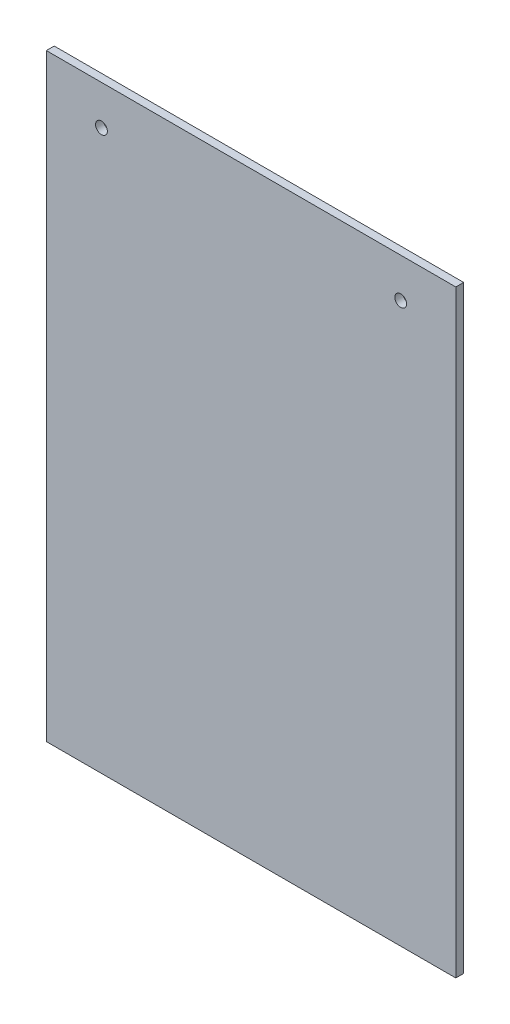
ISO-10303-21;
HEADER;
FILE_DESCRIPTION(('STEP AP214'),'2;1');
FILE_NAME('part.step','',(''),(''),'','','');
FILE_SCHEMA(('AUTOMOTIVE_DESIGN { 1 0 10303 214 1 1 1 1 }'));
ENDSEC;
DATA;
#1=APPLICATION_CONTEXT('core data for automotive mechanical design processes');
#2=APPLICATION_PROTOCOL_DEFINITION('international standard','automotive_design',2000,#1);
#3=PRODUCT_CONTEXT('',#1,'mechanical');
#4=PRODUCT('Part','Part','',(#3));
#5=PRODUCT_RELATED_PRODUCT_CATEGORY('part','',(#4));
#6=PRODUCT_DEFINITION_FORMATION('','',#4);
#7=PRODUCT_DEFINITION_CONTEXT('part definition',#1,'design');
#8=PRODUCT_DEFINITION('design','',#6,#7);
#9=PRODUCT_DEFINITION_SHAPE('','',#8);
#10=(LENGTH_UNIT() NAMED_UNIT(*) SI_UNIT(.MILLI.,.METRE.));
#11=(NAMED_UNIT(*) PLANE_ANGLE_UNIT() SI_UNIT($,.RADIAN.));
#12=(NAMED_UNIT(*) SI_UNIT($,.STERADIAN.) SOLID_ANGLE_UNIT());
#13=UNCERTAINTY_MEASURE_WITH_UNIT(LENGTH_MEASURE(1.E-05),#10,'distance_accuracy_value','');
#14=(GEOMETRIC_REPRESENTATION_CONTEXT(3) GLOBAL_UNCERTAINTY_ASSIGNED_CONTEXT((#13)) GLOBAL_UNIT_ASSIGNED_CONTEXT((#10,
#11,#12)) REPRESENTATION_CONTEXT('',''));
#15=CARTESIAN_POINT('',(0.,0.,0.));
#16=DIRECTION('',(0.,0.,1.));
#17=DIRECTION('',(1.,0.,0.));
#18=AXIS2_PLACEMENT_3D('',#15,#16,#17);
#19=CARTESIAN_POINT('',(0.,0.,6.35));
#20=DIRECTION('',(1.,0.,0.));
#21=DIRECTION('',(0.,0.,-1.));
#22=AXIS2_PLACEMENT_3D('',#19,#20,#21);
#23=PLANE('',#22);
#24=DIRECTION('',(0.,-1.,0.));
#25=VECTOR('',#24,1.);
#26=CARTESIAN_POINT('',(0.,0.,0.));
#27=LINE('',#26,#25);
#28=CARTESIAN_POINT('',(0.,482.6,0.));
#29=VERTEX_POINT('',#28);
#30=CARTESIAN_POINT('',(0.,0.,0.));
#31=VERTEX_POINT('',#30);
#32=EDGE_CURVE('E99',#29,#31,#27,.T.);
#33=ORIENTED_EDGE('',*,*,#32,.T.);
#34=DIRECTION('',(0.,0.,-1.));
#35=VECTOR('',#34,1.);
#36=CARTESIAN_POINT('',(0.,0.,6.35));
#37=LINE('',#36,#35);
#38=CARTESIAN_POINT('',(0.,0.,6.35));
#39=VERTEX_POINT('',#38);
#40=EDGE_CURVE('E11',#39,#31,#37,.T.);
#41=ORIENTED_EDGE('',*,*,#40,.F.);
#42=DIRECTION('',(0.,-1.,0.));
#43=VECTOR('',#42,1.);
#44=CARTESIAN_POINT('',(0.,0.,6.35));
#45=LINE('',#44,#43);
#46=CARTESIAN_POINT('',(0.,482.6,6.35));
#47=VERTEX_POINT('',#46);
#48=EDGE_CURVE('E87',#47,#39,#45,.T.);
#49=ORIENTED_EDGE('',*,*,#48,.F.);
#50=DIRECTION('',(0.,0.,-1.));
#51=VECTOR('',#50,1.);
#52=CARTESIAN_POINT('',(0.,482.6,6.35));
#53=LINE('',#52,#51);
#54=EDGE_CURVE('E95',#47,#29,#53,.T.);
#55=ORIENTED_EDGE('',*,*,#54,.T.);
#56=EDGE_LOOP('',(#33,#41,#49,#55));
#57=FACE_BOUND('',#56,.T.);
#58=ADVANCED_FACE('F36',(#57),#23,.F.);
#59=CARTESIAN_POINT('',(0.,0.,6.35));
#60=DIRECTION('',(0.,1.,0.));
#61=DIRECTION('',(0.,0.,1.));
#62=AXIS2_PLACEMENT_3D('',#59,#60,#61);
#63=PLANE('',#62);
#64=DIRECTION('',(1.,0.,0.));
#65=VECTOR('',#64,1.);
#66=CARTESIAN_POINT('',(0.,0.,0.));
#67=LINE('',#66,#65);
#68=CARTESIAN_POINT('',(330.2,0.,0.));
#69=VERTEX_POINT('',#68);
#70=EDGE_CURVE('E91',#31,#69,#67,.T.);
#71=ORIENTED_EDGE('',*,*,#70,.T.);
#72=DIRECTION('',(0.,0.,-1.));
#73=VECTOR('',#72,1.);
#74=CARTESIAN_POINT('',(330.2,0.,6.35));
#75=LINE('',#74,#73);
#76=CARTESIAN_POINT('',(330.2,0.,6.35));
#77=VERTEX_POINT('',#76);
#78=EDGE_CURVE('E44',#77,#69,#75,.T.);
#79=ORIENTED_EDGE('',*,*,#78,.F.);
#80=DIRECTION('',(1.,0.,0.));
#81=VECTOR('',#80,1.);
#82=CARTESIAN_POINT('',(0.,0.,6.35));
#83=LINE('',#82,#81);
#84=EDGE_CURVE('E82',#39,#77,#83,.T.);
#85=ORIENTED_EDGE('',*,*,#84,.F.);
#86=ORIENTED_EDGE('',*,*,#40,.T.);
#87=EDGE_LOOP('',(#71,#79,#85,#86));
#88=FACE_BOUND('',#87,.T.);
#89=ADVANCED_FACE('F90',(#88),#63,.F.);
#90=CARTESIAN_POINT('',(330.2,0.,6.35));
#91=DIRECTION('',(-1.,0.,0.));
#92=DIRECTION('',(0.,0.,1.));
#93=AXIS2_PLACEMENT_3D('',#90,#91,#92);
#94=PLANE('',#93);
#95=DIRECTION('',(0.,1.,0.));
#96=VECTOR('',#95,1.);
#97=CARTESIAN_POINT('',(330.2,0.,0.));
#98=LINE('',#97,#96);
#99=CARTESIAN_POINT('',(330.2,482.6,0.));
#100=VERTEX_POINT('',#99);
#101=EDGE_CURVE('E69',#69,#100,#98,.T.);
#102=ORIENTED_EDGE('',*,*,#101,.T.);
#103=DIRECTION('',(0.,0.,-1.));
#104=VECTOR('',#103,1.);
#105=CARTESIAN_POINT('',(330.2,482.6,6.35));
#106=LINE('',#105,#104);
#107=CARTESIAN_POINT('',(330.2,482.6,6.35));
#108=VERTEX_POINT('',#107);
#109=EDGE_CURVE('E92',#108,#100,#106,.T.);
#110=ORIENTED_EDGE('',*,*,#109,.F.);
#111=DIRECTION('',(0.,1.,0.));
#112=VECTOR('',#111,1.);
#113=CARTESIAN_POINT('',(330.2,0.,6.35));
#114=LINE('',#113,#112);
#115=EDGE_CURVE('E85',#77,#108,#114,.T.);
#116=ORIENTED_EDGE('',*,*,#115,.F.);
#117=ORIENTED_EDGE('',*,*,#78,.T.);
#118=EDGE_LOOP('',(#102,#110,#116,#117));
#119=FACE_BOUND('',#118,.T.);
#120=ADVANCED_FACE('F93',(#119),#94,.F.);
#121=CARTESIAN_POINT('',(0.,482.6,6.35));
#122=DIRECTION('',(0.,-1.,0.));
#123=DIRECTION('',(0.,0.,-1.));
#124=AXIS2_PLACEMENT_3D('',#121,#122,#123);
#125=PLANE('',#124);
#126=DIRECTION('',(-1.,0.,0.));
#127=VECTOR('',#126,1.);
#128=CARTESIAN_POINT('',(0.,482.6,0.));
#129=LINE('',#128,#127);
#130=EDGE_CURVE('E75',#100,#29,#129,.T.);
#131=ORIENTED_EDGE('',*,*,#130,.T.);
#132=ORIENTED_EDGE('',*,*,#54,.F.);
#133=DIRECTION('',(-1.,0.,0.));
#134=VECTOR('',#133,1.);
#135=CARTESIAN_POINT('',(0.,482.6,6.35));
#136=LINE('',#135,#134);
#137=EDGE_CURVE('E52',#108,#47,#136,.T.);
#138=ORIENTED_EDGE('',*,*,#137,.F.);
#139=ORIENTED_EDGE('',*,*,#109,.T.);
#140=EDGE_LOOP('',(#131,#132,#138,#139));
#141=FACE_BOUND('',#140,.T.);
#142=ADVANCED_FACE('F107',(#141),#125,.F.);
#143=CARTESIAN_POINT('',(0.,0.,6.35));
#144=DIRECTION('',(0.,0.,-1.));
#145=DIRECTION('',(-1.,0.,0.));
#146=AXIS2_PLACEMENT_3D('',#143,#144,#145);
#147=PLANE('',#146);
#148=CARTESIAN_POINT('',(44.45,450.85,6.35));
#149=DIRECTION('',(0.,0.,1.));
#150=DIRECTION('',(1.,0.,0.));
#151=AXIS2_PLACEMENT_3D('',#148,#149,#150);
#152=CIRCLE('',#151,4.7625);
#153=CARTESIAN_POINT('',(49.2125,450.85,6.35));
#154=VERTEX_POINT('',#153);
#155=EDGE_CURVE('E121',#154,#154,#152,.T.);
#156=ORIENTED_EDGE('',*,*,#155,.F.);
#157=EDGE_LOOP('',(#156));
#158=FACE_BOUND('',#157,.T.);
#159=CARTESIAN_POINT('',(285.75,450.85,6.35));
#160=DIRECTION('',(0.,0.,1.));
#161=DIRECTION('',(1.,0.,0.));
#162=AXIS2_PLACEMENT_3D('',#159,#160,#161);
#163=CIRCLE('',#162,4.7625);
#164=CARTESIAN_POINT('',(290.5125,450.85,6.35));
#165=VERTEX_POINT('',#164);
#166=EDGE_CURVE('E115',#165,#165,#163,.T.);
#167=ORIENTED_EDGE('',*,*,#166,.F.);
#168=EDGE_LOOP('',(#167));
#169=FACE_BOUND('',#168,.T.);
#170=ORIENTED_EDGE('',*,*,#48,.T.);
#171=ORIENTED_EDGE('',*,*,#84,.T.);
#172=ORIENTED_EDGE('',*,*,#115,.T.);
#173=ORIENTED_EDGE('',*,*,#137,.T.);
#174=EDGE_LOOP('',(#170,#171,#172,#173));
#175=FACE_BOUND('',#174,.T.);
#176=ADVANCED_FACE('F83',(#158,#169,#175),#147,.F.);
#177=CARTESIAN_POINT('',(0.,0.,0.));
#178=DIRECTION('',(0.,0.,-1.));
#179=DIRECTION('',(-1.,0.,0.));
#180=AXIS2_PLACEMENT_3D('',#177,#178,#179);
#181=PLANE('',#180);
#182=CARTESIAN_POINT('',(44.45,450.85,0.));
#183=DIRECTION('',(0.,0.,1.));
#184=DIRECTION('',(1.,0.,0.));
#185=AXIS2_PLACEMENT_3D('',#182,#183,#184);
#186=CIRCLE('',#185,4.7625);
#187=CARTESIAN_POINT('',(49.2125,450.85,0.));
#188=VERTEX_POINT('',#187);
#189=EDGE_CURVE('E118',#188,#188,#186,.T.);
#190=ORIENTED_EDGE('',*,*,#189,.T.);
#191=EDGE_LOOP('',(#190));
#192=FACE_BOUND('',#191,.T.);
#193=CARTESIAN_POINT('',(285.75,450.85,0.));
#194=DIRECTION('',(0.,0.,1.));
#195=DIRECTION('',(1.,0.,0.));
#196=AXIS2_PLACEMENT_3D('',#193,#194,#195);
#197=CIRCLE('',#196,4.7625);
#198=CARTESIAN_POINT('',(290.5125,450.85,0.));
#199=VERTEX_POINT('',#198);
#200=EDGE_CURVE('E102',#199,#199,#197,.T.);
#201=ORIENTED_EDGE('',*,*,#200,.T.);
#202=EDGE_LOOP('',(#201));
#203=FACE_BOUND('',#202,.T.);
#204=ORIENTED_EDGE('',*,*,#32,.F.);
#205=ORIENTED_EDGE('',*,*,#130,.F.);
#206=ORIENTED_EDGE('',*,*,#101,.F.);
#207=ORIENTED_EDGE('',*,*,#70,.F.);
#208=EDGE_LOOP('',(#204,#205,#206,#207));
#209=FACE_BOUND('',#208,.T.);
#210=ADVANCED_FACE('F110',(#192,#203,#209),#181,.T.);
#211=CARTESIAN_POINT('',(285.75,450.85,6.35));
#212=DIRECTION('',(0.,0.,1.));
#213=DIRECTION('',(1.,0.,0.));
#214=AXIS2_PLACEMENT_3D('',#211,#212,#213);
#215=CYLINDRICAL_SURFACE('',#214,4.7625);
#216=ORIENTED_EDGE('',*,*,#200,.F.);
#217=EDGE_LOOP('',(#216));
#218=FACE_BOUND('',#217,.T.);
#219=ORIENTED_EDGE('',*,*,#166,.T.);
#220=EDGE_LOOP('',(#219));
#221=FACE_BOUND('',#220,.T.);
#222=ADVANCED_FACE('F132',(#218,#221),#215,.F.);
#223=CARTESIAN_POINT('',(44.45,450.85,6.35));
#224=DIRECTION('',(0.,0.,1.));
#225=DIRECTION('',(1.,0.,0.));
#226=AXIS2_PLACEMENT_3D('',#223,#224,#225);
#227=CYLINDRICAL_SURFACE('',#226,4.7625);
#228=ORIENTED_EDGE('',*,*,#189,.F.);
#229=EDGE_LOOP('',(#228));
#230=FACE_BOUND('',#229,.T.);
#231=ORIENTED_EDGE('',*,*,#155,.T.);
#232=EDGE_LOOP('',(#231));
#233=FACE_BOUND('',#232,.T.);
#234=ADVANCED_FACE('F125',(#230,#233),#227,.F.);
#235=CLOSED_SHELL('',(#58,#89,#120,#142,#176,#210,#222,#234));
#236=MANIFOLD_SOLID_BREP('B2',#235);
#237=ADVANCED_BREP_SHAPE_REPRESENTATION('',(#18,#236),#14);
#238=SHAPE_DEFINITION_REPRESENTATION(#9,#237);
ENDSEC;
END-ISO-10303-21;
